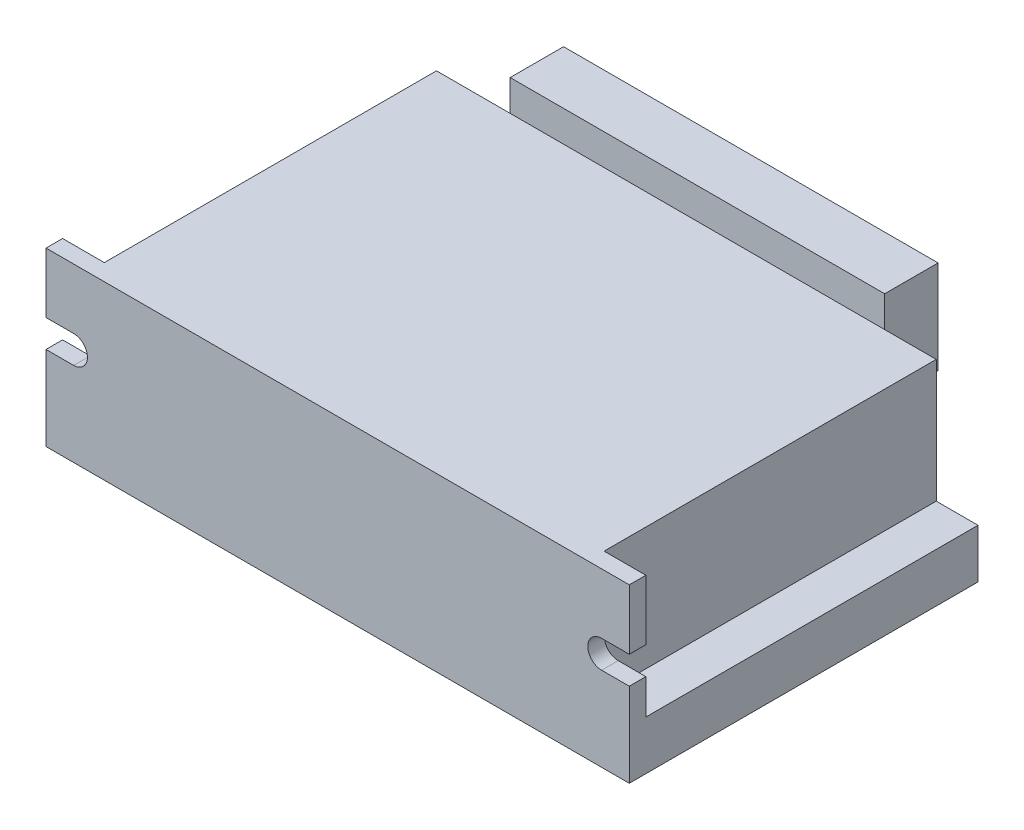
ISO-10303-21;
HEADER;
FILE_DESCRIPTION(('STEP AP214'),'2;1');
FILE_NAME('part.step','',(''),(''),'','','');
FILE_SCHEMA(('AUTOMOTIVE_DESIGN { 1 0 10303 214 1 1 1 1 }'));
ENDSEC;
DATA;
#1=APPLICATION_CONTEXT('core data for automotive mechanical design processes');
#2=APPLICATION_PROTOCOL_DEFINITION('international standard','automotive_design',2000,#1);
#3=PRODUCT_CONTEXT('',#1,'mechanical');
#4=PRODUCT('Part','Part','',(#3));
#5=PRODUCT_RELATED_PRODUCT_CATEGORY('part','',(#4));
#6=PRODUCT_DEFINITION_FORMATION('','',#4);
#7=PRODUCT_DEFINITION_CONTEXT('part definition',#1,'design');
#8=PRODUCT_DEFINITION('design','',#6,#7);
#9=PRODUCT_DEFINITION_SHAPE('','',#8);
#10=(LENGTH_UNIT() NAMED_UNIT(*) SI_UNIT(.MILLI.,.METRE.));
#11=(NAMED_UNIT(*) PLANE_ANGLE_UNIT() SI_UNIT($,.RADIAN.));
#12=(NAMED_UNIT(*) SI_UNIT($,.STERADIAN.) SOLID_ANGLE_UNIT());
#13=UNCERTAINTY_MEASURE_WITH_UNIT(LENGTH_MEASURE(1.E-05),#10,'distance_accuracy_value','');
#14=(GEOMETRIC_REPRESENTATION_CONTEXT(3) GLOBAL_UNCERTAINTY_ASSIGNED_CONTEXT((#13)) GLOBAL_UNIT_ASSIGNED_CONTEXT((#10,
#11,#12)) REPRESENTATION_CONTEXT('',''));
#15=CARTESIAN_POINT('',(0.,0.,0.));
#16=DIRECTION('',(0.,0.,1.));
#17=DIRECTION('',(1.,0.,0.));
#18=AXIS2_PLACEMENT_3D('',#15,#16,#17);
#19=CARTESIAN_POINT('',(95.,0.,0.));
#20=DIRECTION('',(-1.,0.,0.));
#21=DIRECTION('',(0.,0.,1.));
#22=AXIS2_PLACEMENT_3D('',#19,#20,#21);
#23=PLANE('',#22);
#24=DIRECTION('',(0.,-1.,0.));
#25=VECTOR('',#24,1.);
#26=CARTESIAN_POINT('',(95.,0.,56.8));
#27=LINE('',#26,#25);
#28=CARTESIAN_POINT('',(95.,28.,56.8));
#29=VERTEX_POINT('',#28);
#30=CARTESIAN_POINT('',(95.,18.2,56.8));
#31=VERTEX_POINT('',#30);
#32=EDGE_CURVE('E383',#29,#31,#27,.T.);
#33=ORIENTED_EDGE('',*,*,#32,.T.);
#34=DIRECTION('',(0.,0.,-1.));
#35=VECTOR('',#34,1.);
#36=CARTESIAN_POINT('',(95.,18.2,0.));
#37=LINE('',#36,#35);
#38=CARTESIAN_POINT('',(95.,18.2,54.1));
#39=VERTEX_POINT('',#38);
#40=EDGE_CURVE('E11',#31,#39,#37,.T.);
#41=ORIENTED_EDGE('',*,*,#40,.T.);
#42=DIRECTION('',(0.,1.,0.));
#43=VECTOR('',#42,1.);
#44=CARTESIAN_POINT('',(95.,28.,54.1));
#45=LINE('',#44,#43);
#46=CARTESIAN_POINT('',(95.,28.,54.1));
#47=VERTEX_POINT('',#46);
#48=EDGE_CURVE('E374',#39,#47,#45,.T.);
#49=ORIENTED_EDGE('',*,*,#48,.T.);
#50=DIRECTION('',(0.,0.,1.));
#51=VECTOR('',#50,1.);
#52=CARTESIAN_POINT('',(95.,28.,56.8));
#53=LINE('',#52,#51);
#54=EDGE_CURVE('E379',#47,#29,#53,.T.);
#55=ORIENTED_EDGE('',*,*,#54,.T.);
#56=EDGE_LOOP('',(#33,#41,#49,#55));
#57=FACE_BOUND('',#56,.T.);
#58=ADVANCED_FACE('F41',(#57),#23,.F.);
#59=CARTESIAN_POINT('',(0.,0.,0.));
#60=DIRECTION('',(-1.,0.,0.));
#61=DIRECTION('',(0.,0.,1.));
#62=AXIS2_PLACEMENT_3D('',#59,#60,#61);
#63=PLANE('',#62);
#64=DIRECTION('',(0.,0.,1.));
#65=VECTOR('',#64,1.);
#66=CARTESIAN_POINT('',(0.,13.7,0.));
#67=LINE('',#66,#65);
#68=CARTESIAN_POINT('',(0.,13.7,54.1));
#69=VERTEX_POINT('',#68);
#70=CARTESIAN_POINT('',(0.,13.7,56.8));
#71=VERTEX_POINT('',#70);
#72=EDGE_CURVE('E439',#69,#71,#67,.T.);
#73=ORIENTED_EDGE('',*,*,#72,.F.);
#74=DIRECTION('',(0.,1.,0.));
#75=VECTOR('',#74,1.);
#76=CARTESIAN_POINT('',(0.,28.,54.1));
#77=LINE('',#76,#75);
#78=CARTESIAN_POINT('',(0.,8.,54.1));
#79=VERTEX_POINT('',#78);
#80=EDGE_CURVE('E399',#79,#69,#77,.T.);
#81=ORIENTED_EDGE('',*,*,#80,.F.);
#82=DIRECTION('',(0.,0.,1.));
#83=VECTOR('',#82,1.);
#84=CARTESIAN_POINT('',(0.,8.,54.1));
#85=LINE('',#84,#83);
#86=CARTESIAN_POINT('',(0.,8.,0.));
#87=VERTEX_POINT('',#86);
#88=EDGE_CURVE('E394',#87,#79,#85,.T.);
#89=ORIENTED_EDGE('',*,*,#88,.F.);
#90=DIRECTION('',(0.,1.,0.));
#91=VECTOR('',#90,1.);
#92=CARTESIAN_POINT('',(0.,8.,0.));
#93=LINE('',#92,#91);
#94=CARTESIAN_POINT('',(0.,0.,0.));
#95=VERTEX_POINT('',#94);
#96=EDGE_CURVE('E365',#95,#87,#93,.T.);
#97=ORIENTED_EDGE('',*,*,#96,.F.);
#98=DIRECTION('',(0.,0.,-1.));
#99=VECTOR('',#98,1.);
#100=CARTESIAN_POINT('',(0.,0.,0.));
#101=LINE('',#100,#99);
#102=CARTESIAN_POINT('',(0.,0.,56.8));
#103=VERTEX_POINT('',#102);
#104=EDGE_CURVE('E371',#103,#95,#101,.T.);
#105=ORIENTED_EDGE('',*,*,#104,.F.);
#106=DIRECTION('',(0.,-1.,0.));
#107=VECTOR('',#106,1.);
#108=CARTESIAN_POINT('',(0.,0.,56.8));
#109=LINE('',#108,#107);
#110=EDGE_CURVE('E406',#71,#103,#109,.T.);
#111=ORIENTED_EDGE('',*,*,#110,.F.);
#112=EDGE_LOOP('',(#73,#81,#89,#97,#105,#111));
#113=FACE_BOUND('',#112,.T.);
#114=ADVANCED_FACE('F469',(#113),#63,.T.);
#115=CARTESIAN_POINT('',(75.5,21.5536142052368,-13.));
#116=DIRECTION('',(0.,-1.,0.));
#117=DIRECTION('',(0.,0.,-1.));
#118=AXIS2_PLACEMENT_3D('',#115,#116,#117);
#119=PLANE('',#118);
#120=DIRECTION('',(1.,0.,0.));
#121=VECTOR('',#120,1.);
#122=CARTESIAN_POINT('',(14.5,21.5536142052368,-4.3));
#123=LINE('',#122,#121);
#124=CARTESIAN_POINT('',(14.5,21.5536142052368,-4.3));
#125=VERTEX_POINT('',#124);
#126=CARTESIAN_POINT('',(75.5,21.5536142052368,-4.3));
#127=VERTEX_POINT('',#126);
#128=EDGE_CURVE('E270',#125,#127,#123,.T.);
#129=ORIENTED_EDGE('',*,*,#128,.F.);
#130=DIRECTION('',(0.,0.,1.));
#131=VECTOR('',#130,1.);
#132=CARTESIAN_POINT('',(14.5,21.5536142052368,-13.));
#133=LINE('',#132,#131);
#134=CARTESIAN_POINT('',(14.5,21.5536142052368,0.));
#135=VERTEX_POINT('',#134);
#136=EDGE_CURVE('E324',#125,#135,#133,.T.);
#137=ORIENTED_EDGE('',*,*,#136,.T.);
#138=DIRECTION('',(1.,0.,0.));
#139=VECTOR('',#138,1.);
#140=CARTESIAN_POINT('',(75.5,21.5536142052368,0.));
#141=LINE('',#140,#139);
#142=CARTESIAN_POINT('',(75.5,21.5536142052368,0.));
#143=VERTEX_POINT('',#142);
#144=EDGE_CURVE('E301',#135,#143,#141,.T.);
#145=ORIENTED_EDGE('',*,*,#144,.T.);
#146=DIRECTION('',(0.,0.,1.));
#147=VECTOR('',#146,1.);
#148=CARTESIAN_POINT('',(75.5,21.5536142052368,-13.));
#149=LINE('',#148,#147);
#150=EDGE_CURVE('E307',#127,#143,#149,.T.);
#151=ORIENTED_EDGE('',*,*,#150,.F.);
#152=EDGE_LOOP('',(#129,#137,#145,#151));
#153=FACE_BOUND('',#152,.T.);
#154=ADVANCED_FACE('F481',(#153),#119,.F.);
#155=CARTESIAN_POINT('',(95.,8.,0.));
#156=DIRECTION('',(0.,0.,1.));
#157=DIRECTION('',(1.,0.,0.));
#158=AXIS2_PLACEMENT_3D('',#155,#156,#157);
#159=PLANE('',#158);
#160=ORIENTED_EDGE('',*,*,#96,.T.);
#161=DIRECTION('',(-1.,0.,0.));
#162=VECTOR('',#161,1.);
#163=CARTESIAN_POINT('',(95.,8.,0.));
#164=LINE('',#163,#162);
#165=CARTESIAN_POINT('',(6.8,8.,0.));
#166=VERTEX_POINT('',#165);
#167=EDGE_CURVE('E431',#166,#87,#164,.T.);
#168=ORIENTED_EDGE('',*,*,#167,.F.);
#169=DIRECTION('',(0.,-1.,0.));
#170=VECTOR('',#169,1.);
#171=CARTESIAN_POINT('',(6.8,28.,0.));
#172=LINE('',#171,#170);
#173=CARTESIAN_POINT('',(6.8,28.,0.));
#174=VERTEX_POINT('',#173);
#175=EDGE_CURVE('E347',#174,#166,#172,.T.);
#176=ORIENTED_EDGE('',*,*,#175,.F.);
#177=DIRECTION('',(-1.,0.,0.));
#178=VECTOR('',#177,1.);
#179=CARTESIAN_POINT('',(6.8,28.,0.));
#180=LINE('',#179,#178);
#181=CARTESIAN_POINT('',(88.2,28.,0.));
#182=VERTEX_POINT('',#181);
#183=EDGE_CURVE('E344',#182,#174,#180,.T.);
#184=ORIENTED_EDGE('',*,*,#183,.F.);
#185=DIRECTION('',(0.,-1.,0.));
#186=VECTOR('',#185,1.);
#187=CARTESIAN_POINT('',(88.2,28.,0.));
#188=LINE('',#187,#186);
#189=CARTESIAN_POINT('',(88.2,8.,0.));
#190=VERTEX_POINT('',#189);
#191=EDGE_CURVE('E354',#182,#190,#188,.T.);
#192=ORIENTED_EDGE('',*,*,#191,.T.);
#193=CARTESIAN_POINT('',(95.,8.,0.));
#194=VERTEX_POINT('',#193);
#195=EDGE_CURVE('E432',#194,#190,#164,.T.);
#196=ORIENTED_EDGE('',*,*,#195,.F.);
#197=DIRECTION('',(0.,1.,0.));
#198=VECTOR('',#197,1.);
#199=CARTESIAN_POINT('',(95.,8.,0.));
#200=LINE('',#199,#198);
#201=CARTESIAN_POINT('',(95.,0.,0.));
#202=VERTEX_POINT('',#201);
#203=EDGE_CURVE('E366',#202,#194,#200,.T.);
#204=ORIENTED_EDGE('',*,*,#203,.F.);
#205=DIRECTION('',(-1.,0.,0.));
#206=VECTOR('',#205,1.);
#207=CARTESIAN_POINT('',(95.,0.,0.));
#208=LINE('',#207,#206);
#209=EDGE_CURVE('E390',#202,#95,#208,.T.);
#210=ORIENTED_EDGE('',*,*,#209,.T.);
#211=EDGE_LOOP('',(#160,#168,#176,#184,#192,#196,#204,#210));
#212=FACE_BOUND('',#211,.T.);
#213=DIRECTION('',(0.,-1.,0.));
#214=VECTOR('',#213,1.);
#215=CARTESIAN_POINT('',(75.5,13.5536142052368,0.));
#216=LINE('',#215,#214);
#217=CARTESIAN_POINT('',(75.5,13.5536142052368,0.));
#218=VERTEX_POINT('',#217);
#219=EDGE_CURVE('E295',#143,#218,#216,.T.);
#220=ORIENTED_EDGE('',*,*,#219,.F.);
#221=ORIENTED_EDGE('',*,*,#144,.F.);
#222=DIRECTION('',(0.,1.,0.));
#223=VECTOR('',#222,1.);
#224=CARTESIAN_POINT('',(14.5,13.5536142052368,0.));
#225=LINE('',#224,#223);
#226=CARTESIAN_POINT('',(14.5,13.5536142052368,0.));
#227=VERTEX_POINT('',#226);
#228=EDGE_CURVE('E315',#227,#135,#225,.T.);
#229=ORIENTED_EDGE('',*,*,#228,.F.);
#230=DIRECTION('',(-1.,0.,0.));
#231=VECTOR('',#230,1.);
#232=CARTESIAN_POINT('',(75.5,13.5536142052368,0.));
#233=LINE('',#232,#231);
#234=EDGE_CURVE('E311',#218,#227,#233,.T.);
#235=ORIENTED_EDGE('',*,*,#234,.F.);
#236=EDGE_LOOP('',(#220,#221,#229,#235));
#237=FACE_BOUND('',#236,.T.);
#238=ADVANCED_FACE('F43',(#212,#237),#159,.F.);
#239=CARTESIAN_POINT('',(95.,8.,54.1));
#240=DIRECTION('',(0.,-1.,0.));
#241=DIRECTION('',(0.,0.,-1.));
#242=AXIS2_PLACEMENT_3D('',#239,#240,#241);
#243=PLANE('',#242);
#244=DIRECTION('',(0.,0.,1.));
#245=VECTOR('',#244,1.);
#246=CARTESIAN_POINT('',(6.8,8.,54.1));
#247=LINE('',#246,#245);
#248=CARTESIAN_POINT('',(6.8,8.,54.1));
#249=VERTEX_POINT('',#248);
#250=EDGE_CURVE('E335',#166,#249,#247,.T.);
#251=ORIENTED_EDGE('',*,*,#250,.F.);
#252=ORIENTED_EDGE('',*,*,#167,.T.);
#253=ORIENTED_EDGE('',*,*,#88,.T.);
#254=DIRECTION('',(-1.,0.,0.));
#255=VECTOR('',#254,1.);
#256=CARTESIAN_POINT('',(95.,8.,54.1));
#257=LINE('',#256,#255);
#258=EDGE_CURVE('E426',#249,#79,#257,.T.);
#259=ORIENTED_EDGE('',*,*,#258,.F.);
#260=EDGE_LOOP('',(#251,#252,#253,#259));
#261=FACE_BOUND('',#260,.T.);
#262=ADVANCED_FACE('F571',(#261),#243,.F.);
#263=DIRECTION('',(0.,0.,-1.));
#264=VECTOR('',#263,1.);
#265=CARTESIAN_POINT('',(88.2,8.,54.1));
#266=LINE('',#265,#264);
#267=CARTESIAN_POINT('',(88.2,8.,54.1));
#268=VERTEX_POINT('',#267);
#269=EDGE_CURVE('E341',#268,#190,#266,.T.);
#270=ORIENTED_EDGE('',*,*,#269,.F.);
#271=CARTESIAN_POINT('',(95.,8.,54.1));
#272=VERTEX_POINT('',#271);
#273=EDGE_CURVE('E427',#272,#268,#257,.T.);
#274=ORIENTED_EDGE('',*,*,#273,.F.);
#275=DIRECTION('',(0.,0.,1.));
#276=VECTOR('',#275,1.);
#277=CARTESIAN_POINT('',(95.,8.,54.1));
#278=LINE('',#277,#276);
#279=EDGE_CURVE('E370',#194,#272,#278,.T.);
#280=ORIENTED_EDGE('',*,*,#279,.F.);
#281=ORIENTED_EDGE('',*,*,#195,.T.);
#282=EDGE_LOOP('',(#270,#274,#280,#281));
#283=FACE_BOUND('',#282,.T.);
#284=ADVANCED_FACE('F554',(#283),#243,.F.);
#285=CARTESIAN_POINT('',(95.,28.,54.1));
#286=DIRECTION('',(0.,0.,1.));
#287=DIRECTION('',(0.,-1.,0.));
#288=AXIS2_PLACEMENT_3D('',#285,#286,#287);
#289=PLANE('',#288);
#290=ORIENTED_EDGE('',*,*,#80,.T.);
#291=DIRECTION('',(1.,0.,0.));
#292=VECTOR('',#291,1.);
#293=CARTESIAN_POINT('',(95.,13.7,54.1));
#294=LINE('',#293,#292);
#295=CARTESIAN_POINT('',(4.5,13.7,54.1));
#296=VERTEX_POINT('',#295);
#297=EDGE_CURVE('E251',#69,#296,#294,.T.);
#298=ORIENTED_EDGE('',*,*,#297,.T.);
#299=CARTESIAN_POINT('',(4.5,15.95,54.1));
#300=DIRECTION('',(0.,0.,1.));
#301=DIRECTION('',(0.,-1.,0.));
#302=AXIS2_PLACEMENT_3D('',#299,#300,#301);
#303=CIRCLE('',#302,2.25);
#304=CARTESIAN_POINT('',(4.5,18.2,54.1));
#305=VERTEX_POINT('',#304);
#306=EDGE_CURVE('E267',#296,#305,#303,.T.);
#307=ORIENTED_EDGE('',*,*,#306,.T.);
#308=DIRECTION('',(-1.,0.,0.));
#309=VECTOR('',#308,1.);
#310=CARTESIAN_POINT('',(95.,18.1999999999999,54.1));
#311=LINE('',#310,#309);
#312=CARTESIAN_POINT('',(0.,18.2,54.1));
#313=VERTEX_POINT('',#312);
#314=EDGE_CURVE('E205',#305,#313,#311,.T.);
#315=ORIENTED_EDGE('',*,*,#314,.T.);
#316=CARTESIAN_POINT('',(0.,28.,54.1));
#317=VERTEX_POINT('',#316);
#318=EDGE_CURVE('E398',#313,#317,#77,.T.);
#319=ORIENTED_EDGE('',*,*,#318,.T.);
#320=DIRECTION('',(-1.,0.,0.));
#321=VECTOR('',#320,1.);
#322=CARTESIAN_POINT('',(95.,28.,54.1));
#323=LINE('',#322,#321);
#324=CARTESIAN_POINT('',(6.8,28.,54.1));
#325=VERTEX_POINT('',#324);
#326=EDGE_CURVE('E421',#325,#317,#323,.T.);
#327=ORIENTED_EDGE('',*,*,#326,.F.);
#328=DIRECTION('',(0.,-1.,0.));
#329=VECTOR('',#328,1.);
#330=CARTESIAN_POINT('',(6.8,28.,54.1));
#331=LINE('',#330,#329);
#332=EDGE_CURVE('E361',#325,#249,#331,.T.);
#333=ORIENTED_EDGE('',*,*,#332,.T.);
#334=ORIENTED_EDGE('',*,*,#258,.T.);
#335=EDGE_LOOP('',(#290,#298,#307,#315,#319,#327,#333,#334));
#336=FACE_BOUND('',#335,.T.);
#337=ADVANCED_FACE('F457',(#336),#289,.F.);
#338=ORIENTED_EDGE('',*,*,#48,.F.);
#339=DIRECTION('',(-1.,0.,0.));
#340=VECTOR('',#339,1.);
#341=CARTESIAN_POINT('',(95.,18.2,54.1));
#342=LINE('',#341,#340);
#343=CARTESIAN_POINT('',(90.5,18.2,54.1));
#344=VERTEX_POINT('',#343);
#345=EDGE_CURVE('E259',#39,#344,#342,.T.);
#346=ORIENTED_EDGE('',*,*,#345,.T.);
#347=CARTESIAN_POINT('',(90.5,15.95,54.1));
#348=DIRECTION('',(0.,0.,1.));
#349=DIRECTION('',(0.,-1.,0.));
#350=AXIS2_PLACEMENT_3D('',#347,#348,#349);
#351=CIRCLE('',#350,2.25);
#352=CARTESIAN_POINT('',(90.5,13.7,54.1));
#353=VERTEX_POINT('',#352);
#354=EDGE_CURVE('E263',#344,#353,#351,.T.);
#355=ORIENTED_EDGE('',*,*,#354,.T.);
#356=DIRECTION('',(1.,0.,0.));
#357=VECTOR('',#356,1.);
#358=CARTESIAN_POINT('',(95.,13.7,54.1));
#359=LINE('',#358,#357);
#360=CARTESIAN_POINT('',(95.,13.7,54.1));
#361=VERTEX_POINT('',#360);
#362=EDGE_CURVE('E255',#353,#361,#359,.T.);
#363=ORIENTED_EDGE('',*,*,#362,.T.);
#364=EDGE_CURVE('E375',#272,#361,#45,.T.);
#365=ORIENTED_EDGE('',*,*,#364,.F.);
#366=ORIENTED_EDGE('',*,*,#273,.T.);
#367=DIRECTION('',(0.,-1.,0.));
#368=VECTOR('',#367,1.);
#369=CARTESIAN_POINT('',(88.2,28.,54.1));
#370=LINE('',#369,#368);
#371=CARTESIAN_POINT('',(88.2,28.,54.1));
#372=VERTEX_POINT('',#371);
#373=EDGE_CURVE('E358',#372,#268,#370,.T.);
#374=ORIENTED_EDGE('',*,*,#373,.F.);
#375=EDGE_CURVE('E422',#47,#372,#323,.T.);
#376=ORIENTED_EDGE('',*,*,#375,.F.);
#377=EDGE_LOOP('',(#338,#346,#355,#363,#365,#366,#374,#376));
#378=FACE_BOUND('',#377,.T.);
#379=ADVANCED_FACE('F558',(#378),#289,.F.);
#380=CARTESIAN_POINT('',(95.,28.,56.8));
#381=DIRECTION('',(0.,-1.,0.));
#382=DIRECTION('',(0.,0.,-1.));
#383=AXIS2_PLACEMENT_3D('',#380,#381,#382);
#384=PLANE('',#383);
#385=DIRECTION('',(0.,0.,1.));
#386=VECTOR('',#385,1.);
#387=CARTESIAN_POINT('',(0.,28.,56.8));
#388=LINE('',#387,#386);
#389=CARTESIAN_POINT('',(0.,28.,56.8));
#390=VERTEX_POINT('',#389);
#391=EDGE_CURVE('E403',#317,#390,#388,.T.);
#392=ORIENTED_EDGE('',*,*,#391,.T.);
#393=DIRECTION('',(-1.,0.,0.));
#394=VECTOR('',#393,1.);
#395=CARTESIAN_POINT('',(95.,28.,56.8));
#396=LINE('',#395,#394);
#397=EDGE_CURVE('E418',#29,#390,#396,.T.);
#398=ORIENTED_EDGE('',*,*,#397,.F.);
#399=ORIENTED_EDGE('',*,*,#54,.F.);
#400=ORIENTED_EDGE('',*,*,#375,.T.);
#401=DIRECTION('',(0.,0.,-1.));
#402=VECTOR('',#401,1.);
#403=CARTESIAN_POINT('',(88.2,28.,54.1));
#404=LINE('',#403,#402);
#405=EDGE_CURVE('E340',#372,#182,#404,.T.);
#406=ORIENTED_EDGE('',*,*,#405,.T.);
#407=ORIENTED_EDGE('',*,*,#183,.T.);
#408=DIRECTION('',(0.,0.,1.));
#409=VECTOR('',#408,1.);
#410=CARTESIAN_POINT('',(6.8,28.,54.1));
#411=LINE('',#410,#409);
#412=EDGE_CURVE('E336',#174,#325,#411,.T.);
#413=ORIENTED_EDGE('',*,*,#412,.T.);
#414=ORIENTED_EDGE('',*,*,#326,.T.);
#415=EDGE_LOOP('',(#392,#398,#399,#400,#406,#407,#413,#414));
#416=FACE_BOUND('',#415,.T.);
#417=ADVANCED_FACE('F461',(#416),#384,.F.);
#418=CARTESIAN_POINT('',(95.,0.,56.8));
#419=DIRECTION('',(0.,0.,-1.));
#420=DIRECTION('',(-1.,0.,0.));
#421=AXIS2_PLACEMENT_3D('',#418,#419,#420);
#422=PLANE('',#421);
#423=CARTESIAN_POINT('',(4.5,15.95,56.8));
#424=DIRECTION('',(0.,0.,1.));
#425=DIRECTION('',(1.,0.,0.));
#426=AXIS2_PLACEMENT_3D('',#423,#424,#425);
#427=CIRCLE('',#426,2.25);
#428=CARTESIAN_POINT('',(4.5,13.7,56.8));
#429=VERTEX_POINT('',#428);
#430=CARTESIAN_POINT('',(4.5,18.2,56.8));
#431=VERTEX_POINT('',#430);
#432=EDGE_CURVE('E213',#429,#431,#427,.T.);
#433=ORIENTED_EDGE('',*,*,#432,.F.);
#434=DIRECTION('',(1.,0.,0.));
#435=VECTOR('',#434,1.);
#436=CARTESIAN_POINT('',(4.5,13.7,56.8));
#437=LINE('',#436,#435);
#438=EDGE_CURVE('E210',#71,#429,#437,.T.);
#439=ORIENTED_EDGE('',*,*,#438,.F.);
#440=ORIENTED_EDGE('',*,*,#110,.T.);
#441=DIRECTION('',(-1.,0.,0.));
#442=VECTOR('',#441,1.);
#443=CARTESIAN_POINT('',(95.,0.,56.8));
#444=LINE('',#443,#442);
#445=CARTESIAN_POINT('',(95.,0.,56.8));
#446=VERTEX_POINT('',#445);
#447=EDGE_CURVE('E414',#446,#103,#444,.T.);
#448=ORIENTED_EDGE('',*,*,#447,.F.);
#449=CARTESIAN_POINT('',(95.,13.7,56.8));
#450=VERTEX_POINT('',#449);
#451=EDGE_CURVE('E382',#450,#446,#27,.T.);
#452=ORIENTED_EDGE('',*,*,#451,.F.);
#453=DIRECTION('',(1.,0.,0.));
#454=VECTOR('',#453,1.);
#455=CARTESIAN_POINT('',(90.5,13.7,56.8));
#456=LINE('',#455,#454);
#457=CARTESIAN_POINT('',(90.5,13.7,56.8));
#458=VERTEX_POINT('',#457);
#459=EDGE_CURVE('E57',#458,#450,#456,.T.);
#460=ORIENTED_EDGE('',*,*,#459,.F.);
#461=CARTESIAN_POINT('',(90.5,15.95,56.8));
#462=DIRECTION('',(0.,0.,1.));
#463=DIRECTION('',(-1.,0.,0.));
#464=AXIS2_PLACEMENT_3D('',#461,#462,#463);
#465=CIRCLE('',#464,2.25);
#466=CARTESIAN_POINT('',(90.5,18.2,56.8));
#467=VERTEX_POINT('',#466);
#468=EDGE_CURVE('E234',#467,#458,#465,.T.);
#469=ORIENTED_EDGE('',*,*,#468,.F.);
#470=DIRECTION('',(-1.,0.,0.));
#471=VECTOR('',#470,1.);
#472=CARTESIAN_POINT('',(90.5,18.2,56.8));
#473=LINE('',#472,#471);
#474=EDGE_CURVE('E240',#31,#467,#473,.T.);
#475=ORIENTED_EDGE('',*,*,#474,.F.);
#476=ORIENTED_EDGE('',*,*,#32,.F.);
#477=ORIENTED_EDGE('',*,*,#397,.T.);
#478=CARTESIAN_POINT('',(0.,18.2,56.8));
#479=VERTEX_POINT('',#478);
#480=EDGE_CURVE('E226',#390,#479,#109,.T.);
#481=ORIENTED_EDGE('',*,*,#480,.T.);
#482=DIRECTION('',(-1.,0.,0.));
#483=VECTOR('',#482,1.);
#484=CARTESIAN_POINT('',(4.5,18.2,56.8));
#485=LINE('',#484,#483);
#486=EDGE_CURVE('E65',#431,#479,#485,.T.);
#487=ORIENTED_EDGE('',*,*,#486,.F.);
#488=EDGE_LOOP('',(#433,#439,#440,#448,#452,#460,#469,#475,#476,#477,#481,#487));
#489=FACE_BOUND('',#488,.T.);
#490=ADVANCED_FACE('F223',(#489),#422,.F.);
#491=CARTESIAN_POINT('',(95.,0.,0.));
#492=DIRECTION('',(0.,1.,0.));
#493=DIRECTION('',(0.,0.,1.));
#494=AXIS2_PLACEMENT_3D('',#491,#492,#493);
#495=PLANE('',#494);
#496=ORIENTED_EDGE('',*,*,#104,.T.);
#497=ORIENTED_EDGE('',*,*,#209,.F.);
#498=DIRECTION('',(0.,0.,-1.));
#499=VECTOR('',#498,1.);
#500=CARTESIAN_POINT('',(95.,0.,0.));
#501=LINE('',#500,#499);
#502=EDGE_CURVE('E387',#446,#202,#501,.T.);
#503=ORIENTED_EDGE('',*,*,#502,.F.);
#504=ORIENTED_EDGE('',*,*,#447,.T.);
#505=EDGE_LOOP('',(#496,#497,#503,#504));
#506=FACE_BOUND('',#505,.T.);
#507=ADVANCED_FACE('F477',(#506),#495,.F.);
#508=ORIENTED_EDGE('',*,*,#364,.T.);
#509=DIRECTION('',(0.,0.,1.));
#510=VECTOR('',#509,1.);
#511=CARTESIAN_POINT('',(95.,13.7,0.));
#512=LINE('',#511,#510);
#513=EDGE_CURVE('E50',#361,#450,#512,.T.);
#514=ORIENTED_EDGE('',*,*,#513,.T.);
#515=ORIENTED_EDGE('',*,*,#451,.T.);
#516=ORIENTED_EDGE('',*,*,#502,.T.);
#517=ORIENTED_EDGE('',*,*,#203,.T.);
#518=ORIENTED_EDGE('',*,*,#279,.T.);
#519=EDGE_LOOP('',(#508,#514,#515,#516,#517,#518));
#520=FACE_BOUND('',#519,.T.);
#521=ADVANCED_FACE('F444',(#520),#23,.F.);
#522=DIRECTION('',(0.,0.,-1.));
#523=VECTOR('',#522,1.);
#524=CARTESIAN_POINT('',(0.,18.2,0.));
#525=LINE('',#524,#523);
#526=EDGE_CURVE('E436',#479,#313,#525,.T.);
#527=ORIENTED_EDGE('',*,*,#526,.F.);
#528=ORIENTED_EDGE('',*,*,#480,.F.);
#529=ORIENTED_EDGE('',*,*,#391,.F.);
#530=ORIENTED_EDGE('',*,*,#318,.F.);
#531=EDGE_LOOP('',(#527,#528,#529,#530));
#532=FACE_BOUND('',#531,.T.);
#533=ADVANCED_FACE('F465',(#532),#63,.T.);
#534=CARTESIAN_POINT('',(6.8,28.,54.1));
#535=DIRECTION('',(1.,0.,0.));
#536=DIRECTION('',(0.,0.,-1.));
#537=AXIS2_PLACEMENT_3D('',#534,#535,#536);
#538=PLANE('',#537);
#539=ORIENTED_EDGE('',*,*,#250,.T.);
#540=ORIENTED_EDGE('',*,*,#332,.F.);
#541=ORIENTED_EDGE('',*,*,#412,.F.);
#542=ORIENTED_EDGE('',*,*,#175,.T.);
#543=EDGE_LOOP('',(#539,#540,#541,#542));
#544=FACE_BOUND('',#543,.T.);
#545=ADVANCED_FACE('F467',(#544),#538,.F.);
#546=CARTESIAN_POINT('',(88.2,28.,54.1));
#547=DIRECTION('',(-1.,0.,0.));
#548=DIRECTION('',(0.,0.,1.));
#549=AXIS2_PLACEMENT_3D('',#546,#547,#548);
#550=PLANE('',#549);
#551=ORIENTED_EDGE('',*,*,#269,.T.);
#552=ORIENTED_EDGE('',*,*,#191,.F.);
#553=ORIENTED_EDGE('',*,*,#405,.F.);
#554=ORIENTED_EDGE('',*,*,#373,.T.);
#555=EDGE_LOOP('',(#551,#552,#553,#554));
#556=FACE_BOUND('',#555,.T.);
#557=ADVANCED_FACE('F474',(#556),#550,.F.);
#558=CARTESIAN_POINT('',(75.5,13.5536142052368,-13.));
#559=DIRECTION('',(-1.,0.,0.));
#560=DIRECTION('',(0.,0.,1.));
#561=AXIS2_PLACEMENT_3D('',#558,#559,#560);
#562=PLANE('',#561);
#563=ORIENTED_EDGE('',*,*,#219,.T.);
#564=DIRECTION('',(0.,0.,1.));
#565=VECTOR('',#564,1.);
#566=CARTESIAN_POINT('',(75.5,13.5536142052368,-13.));
#567=LINE('',#566,#565);
#568=CARTESIAN_POINT('',(75.5,13.5536142052368,-13.));
#569=VERTEX_POINT('',#568);
#570=EDGE_CURVE('E331',#569,#218,#567,.T.);
#571=ORIENTED_EDGE('',*,*,#570,.F.);
#572=DIRECTION('',(0.,-1.,0.));
#573=VECTOR('',#572,1.);
#574=CARTESIAN_POINT('',(75.5,13.5536142052368,-13.));
#575=LINE('',#574,#573);
#576=CARTESIAN_POINT('',(75.5,28.7536142052368,-13.));
#577=VERTEX_POINT('',#576);
#578=EDGE_CURVE('E296',#577,#569,#575,.T.);
#579=ORIENTED_EDGE('',*,*,#578,.F.);
#580=DIRECTION('',(0.,0.,-1.));
#581=VECTOR('',#580,1.);
#582=CARTESIAN_POINT('',(75.5,28.7536142052368,-4.3));
#583=LINE('',#582,#581);
#584=CARTESIAN_POINT('',(75.5,28.7536142052368,-4.3));
#585=VERTEX_POINT('',#584);
#586=EDGE_CURVE('E278',#585,#577,#583,.T.);
#587=ORIENTED_EDGE('',*,*,#586,.F.);
#588=DIRECTION('',(0.,-1.,0.));
#589=VECTOR('',#588,1.);
#590=CARTESIAN_POINT('',(75.5,28.7536142052368,-4.3));
#591=LINE('',#590,#589);
#592=EDGE_CURVE('E286',#585,#127,#591,.T.);
#593=ORIENTED_EDGE('',*,*,#592,.T.);
#594=ORIENTED_EDGE('',*,*,#150,.T.);
#595=EDGE_LOOP('',(#563,#571,#579,#587,#593,#594));
#596=FACE_BOUND('',#595,.T.);
#597=ADVANCED_FACE('F490',(#596),#562,.F.);
#598=CARTESIAN_POINT('',(75.5,13.5536142052368,-13.));
#599=DIRECTION('',(0.,1.,0.));
#600=DIRECTION('',(0.,0.,1.));
#601=AXIS2_PLACEMENT_3D('',#598,#599,#600);
#602=PLANE('',#601);
#603=ORIENTED_EDGE('',*,*,#234,.T.);
#604=DIRECTION('',(0.,0.,1.));
#605=VECTOR('',#604,1.);
#606=CARTESIAN_POINT('',(14.5,13.5536142052368,-13.));
#607=LINE('',#606,#605);
#608=CARTESIAN_POINT('',(14.5,13.5536142052368,-13.));
#609=VERTEX_POINT('',#608);
#610=EDGE_CURVE('E327',#609,#227,#607,.T.);
#611=ORIENTED_EDGE('',*,*,#610,.F.);
#612=DIRECTION('',(-1.,0.,0.));
#613=VECTOR('',#612,1.);
#614=CARTESIAN_POINT('',(75.5,13.5536142052368,-13.));
#615=LINE('',#614,#613);
#616=EDGE_CURVE('E300',#569,#609,#615,.T.);
#617=ORIENTED_EDGE('',*,*,#616,.F.);
#618=ORIENTED_EDGE('',*,*,#570,.T.);
#619=EDGE_LOOP('',(#603,#611,#617,#618));
#620=FACE_BOUND('',#619,.T.);
#621=ADVANCED_FACE('F494',(#620),#602,.F.);
#622=CARTESIAN_POINT('',(14.5,13.5536142052368,-13.));
#623=DIRECTION('',(1.,0.,0.));
#624=DIRECTION('',(0.,0.,-1.));
#625=AXIS2_PLACEMENT_3D('',#622,#623,#624);
#626=PLANE('',#625);
#627=ORIENTED_EDGE('',*,*,#228,.T.);
#628=ORIENTED_EDGE('',*,*,#136,.F.);
#629=DIRECTION('',(0.,-1.,0.));
#630=VECTOR('',#629,1.);
#631=CARTESIAN_POINT('',(14.5,28.7536142052368,-4.3));
#632=LINE('',#631,#630);
#633=CARTESIAN_POINT('',(14.5,28.7536142052368,-4.3));
#634=VERTEX_POINT('',#633);
#635=EDGE_CURVE('E292',#634,#125,#632,.T.);
#636=ORIENTED_EDGE('',*,*,#635,.F.);
#637=DIRECTION('',(0.,0.,1.));
#638=VECTOR('',#637,1.);
#639=CARTESIAN_POINT('',(14.5,28.7536142052368,-4.3));
#640=LINE('',#639,#638);
#641=CARTESIAN_POINT('',(14.5,28.7536142052368,-13.));
#642=VERTEX_POINT('',#641);
#643=EDGE_CURVE('E271',#642,#634,#640,.T.);
#644=ORIENTED_EDGE('',*,*,#643,.F.);
#645=DIRECTION('',(0.,1.,0.));
#646=VECTOR('',#645,1.);
#647=CARTESIAN_POINT('',(14.5,13.5536142052368,-13.));
#648=LINE('',#647,#646);
#649=EDGE_CURVE('E304',#609,#642,#648,.T.);
#650=ORIENTED_EDGE('',*,*,#649,.F.);
#651=ORIENTED_EDGE('',*,*,#610,.T.);
#652=EDGE_LOOP('',(#627,#628,#636,#644,#650,#651));
#653=FACE_BOUND('',#652,.T.);
#654=ADVANCED_FACE('F498',(#653),#626,.F.);
#655=CARTESIAN_POINT('',(0.,0.,-13.));
#656=DIRECTION('',(0.,0.,1.));
#657=DIRECTION('',(1.,0.,0.));
#658=AXIS2_PLACEMENT_3D('',#655,#656,#657);
#659=PLANE('',#658);
#660=ORIENTED_EDGE('',*,*,#578,.T.);
#661=ORIENTED_EDGE('',*,*,#616,.T.);
#662=ORIENTED_EDGE('',*,*,#649,.T.);
#663=DIRECTION('',(-1.,0.,0.));
#664=VECTOR('',#663,1.);
#665=CARTESIAN_POINT('',(14.5,28.7536142052368,-13.));
#666=LINE('',#665,#664);
#667=EDGE_CURVE('E282',#577,#642,#666,.T.);
#668=ORIENTED_EDGE('',*,*,#667,.F.);
#669=EDGE_LOOP('',(#660,#661,#662,#668));
#670=FACE_BOUND('',#669,.T.);
#671=ADVANCED_FACE('F502',(#670),#659,.F.);
#672=CARTESIAN_POINT('',(14.5,28.7536142052368,-4.3));
#673=DIRECTION('',(0.,0.,-1.));
#674=DIRECTION('',(-1.,0.,0.));
#675=AXIS2_PLACEMENT_3D('',#672,#673,#674);
#676=PLANE('',#675);
#677=ORIENTED_EDGE('',*,*,#128,.T.);
#678=ORIENTED_EDGE('',*,*,#592,.F.);
#679=DIRECTION('',(1.,0.,0.));
#680=VECTOR('',#679,1.);
#681=CARTESIAN_POINT('',(14.5,28.7536142052368,-4.3));
#682=LINE('',#681,#680);
#683=EDGE_CURVE('E275',#634,#585,#682,.T.);
#684=ORIENTED_EDGE('',*,*,#683,.F.);
#685=ORIENTED_EDGE('',*,*,#635,.T.);
#686=EDGE_LOOP('',(#677,#678,#684,#685));
#687=FACE_BOUND('',#686,.T.);
#688=ADVANCED_FACE('F509',(#687),#676,.F.);
#689=CARTESIAN_POINT('',(0.,28.7536142052368,0.));
#690=DIRECTION('',(0.,-1.,0.));
#691=DIRECTION('',(0.,0.,-1.));
#692=AXIS2_PLACEMENT_3D('',#689,#690,#691);
#693=PLANE('',#692);
#694=ORIENTED_EDGE('',*,*,#643,.T.);
#695=ORIENTED_EDGE('',*,*,#683,.T.);
#696=ORIENTED_EDGE('',*,*,#586,.T.);
#697=ORIENTED_EDGE('',*,*,#667,.T.);
#698=EDGE_LOOP('',(#694,#695,#696,#697));
#699=FACE_BOUND('',#698,.T.);
#700=ADVANCED_FACE('F513',(#699),#693,.F.);
#701=CARTESIAN_POINT('',(4.5,15.95,-13.));
#702=DIRECTION('',(0.,0.,1.));
#703=DIRECTION('',(1.,0.,0.));
#704=AXIS2_PLACEMENT_3D('',#701,#702,#703);
#705=CYLINDRICAL_SURFACE('',#704,2.25);
#706=DIRECTION('',(0.,0.,1.));
#707=VECTOR('',#706,1.);
#708=CARTESIAN_POINT('',(4.5,13.7,-13.));
#709=LINE('',#708,#707);
#710=EDGE_CURVE('E209',#296,#429,#709,.T.);
#711=ORIENTED_EDGE('',*,*,#710,.T.);
#712=ORIENTED_EDGE('',*,*,#432,.T.);
#713=DIRECTION('',(0.,0.,1.));
#714=VECTOR('',#713,1.);
#715=CARTESIAN_POINT('',(4.5,18.2,-13.));
#716=LINE('',#715,#714);
#717=EDGE_CURVE('E201',#305,#431,#716,.T.);
#718=ORIENTED_EDGE('',*,*,#717,.F.);
#719=ORIENTED_EDGE('',*,*,#306,.F.);
#720=EDGE_LOOP('',(#711,#712,#718,#719));
#721=FACE_BOUND('',#720,.T.);
#722=ADVANCED_FACE('F214',(#721),#705,.F.);
#723=CARTESIAN_POINT('',(4.5,13.7,-13.));
#724=DIRECTION('',(0.,-1.,0.));
#725=DIRECTION('',(1.,0.,0.));
#726=AXIS2_PLACEMENT_3D('',#723,#724,#725);
#727=PLANE('',#726);
#728=ORIENTED_EDGE('',*,*,#72,.T.);
#729=ORIENTED_EDGE('',*,*,#438,.T.);
#730=ORIENTED_EDGE('',*,*,#710,.F.);
#731=ORIENTED_EDGE('',*,*,#297,.F.);
#732=EDGE_LOOP('',(#728,#729,#730,#731));
#733=FACE_BOUND('',#732,.T.);
#734=ADVANCED_FACE('F531',(#733),#727,.F.);
#735=CARTESIAN_POINT('',(4.5,18.2,-13.));
#736=DIRECTION('',(0.,1.,0.));
#737=DIRECTION('',(-1.,0.,0.));
#738=AXIS2_PLACEMENT_3D('',#735,#736,#737);
#739=PLANE('',#738);
#740=ORIENTED_EDGE('',*,*,#717,.T.);
#741=ORIENTED_EDGE('',*,*,#486,.T.);
#742=ORIENTED_EDGE('',*,*,#526,.T.);
#743=ORIENTED_EDGE('',*,*,#314,.F.);
#744=EDGE_LOOP('',(#740,#741,#742,#743));
#745=FACE_BOUND('',#744,.T.);
#746=ADVANCED_FACE('F203',(#745),#739,.F.);
#747=CARTESIAN_POINT('',(90.5,15.95,-13.));
#748=DIRECTION('',(0.,0.,1.));
#749=DIRECTION('',(1.,0.,0.));
#750=AXIS2_PLACEMENT_3D('',#747,#748,#749);
#751=CYLINDRICAL_SURFACE('',#750,2.25);
#752=DIRECTION('',(0.,0.,1.));
#753=VECTOR('',#752,1.);
#754=CARTESIAN_POINT('',(90.5,18.2,-13.));
#755=LINE('',#754,#753);
#756=EDGE_CURVE('E220',#344,#467,#755,.T.);
#757=ORIENTED_EDGE('',*,*,#756,.T.);
#758=ORIENTED_EDGE('',*,*,#468,.T.);
#759=DIRECTION('',(0.,0.,1.));
#760=VECTOR('',#759,1.);
#761=CARTESIAN_POINT('',(90.5,13.7,-13.));
#762=LINE('',#761,#760);
#763=EDGE_CURVE('E244',#353,#458,#762,.T.);
#764=ORIENTED_EDGE('',*,*,#763,.F.);
#765=ORIENTED_EDGE('',*,*,#354,.F.);
#766=EDGE_LOOP('',(#757,#758,#764,#765));
#767=FACE_BOUND('',#766,.T.);
#768=ADVANCED_FACE('F518',(#767),#751,.F.);
#769=CARTESIAN_POINT('',(90.5,18.2,-13.));
#770=DIRECTION('',(0.,1.,0.));
#771=DIRECTION('',(-1.,0.,0.));
#772=AXIS2_PLACEMENT_3D('',#769,#770,#771);
#773=PLANE('',#772);
#774=ORIENTED_EDGE('',*,*,#40,.F.);
#775=ORIENTED_EDGE('',*,*,#474,.T.);
#776=ORIENTED_EDGE('',*,*,#756,.F.);
#777=ORIENTED_EDGE('',*,*,#345,.F.);
#778=EDGE_LOOP('',(#774,#775,#776,#777));
#779=FACE_BOUND('',#778,.T.);
#780=ADVANCED_FACE('F521',(#779),#773,.F.);
#781=CARTESIAN_POINT('',(90.5,13.7,-13.));
#782=DIRECTION('',(0.,-1.,0.));
#783=DIRECTION('',(1.,0.,0.));
#784=AXIS2_PLACEMENT_3D('',#781,#782,#783);
#785=PLANE('',#784);
#786=ORIENTED_EDGE('',*,*,#763,.T.);
#787=ORIENTED_EDGE('',*,*,#459,.T.);
#788=ORIENTED_EDGE('',*,*,#513,.F.);
#789=ORIENTED_EDGE('',*,*,#362,.F.);
#790=EDGE_LOOP('',(#786,#787,#788,#789));
#791=FACE_BOUND('',#790,.T.);
#792=ADVANCED_FACE('F523',(#791),#785,.F.);
#793=CLOSED_SHELL('',(#58,#114,#154,#238,#262,#284,#337,#379,#417,#490,#507,#521,#533,#545,#557,
#597,#621,#654,#671,#688,#700,#722,#734,#746,#768,#780,#792));
#794=MANIFOLD_SOLID_BREP('B2',#793);
#795=ADVANCED_BREP_SHAPE_REPRESENTATION('',(#18,#794),#14);
#796=SHAPE_DEFINITION_REPRESENTATION(#9,#795);
ENDSEC;
END-ISO-10303-21;
